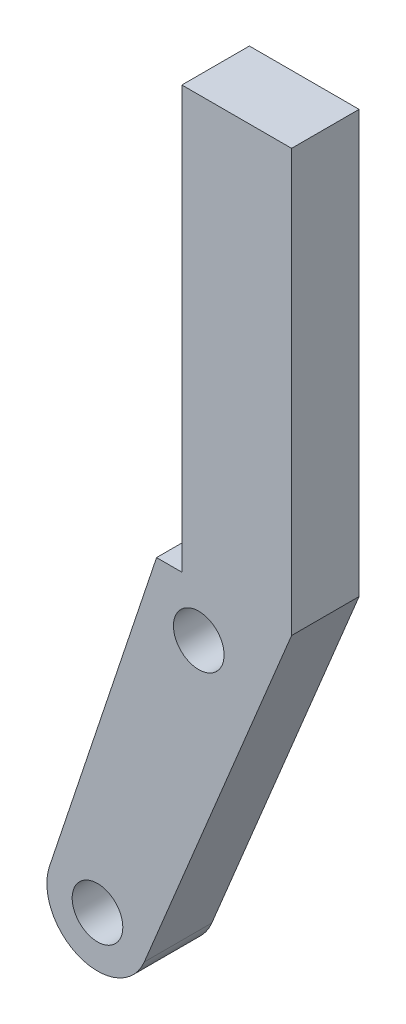
ISO-10303-21;
HEADER;
FILE_DESCRIPTION(('STEP AP214'),'2;1');
FILE_NAME('part.step','',(''),(''),'','','');
FILE_SCHEMA(('AUTOMOTIVE_DESIGN { 1 0 10303 214 1 1 1 1 }'));
ENDSEC;
DATA;
#1=APPLICATION_CONTEXT('core data for automotive mechanical design processes');
#2=APPLICATION_PROTOCOL_DEFINITION('international standard','automotive_design',2000,#1);
#3=PRODUCT_CONTEXT('',#1,'mechanical');
#4=PRODUCT('Part','Part','',(#3));
#5=PRODUCT_RELATED_PRODUCT_CATEGORY('part','',(#4));
#6=PRODUCT_DEFINITION_FORMATION('','',#4);
#7=PRODUCT_DEFINITION_CONTEXT('part definition',#1,'design');
#8=PRODUCT_DEFINITION('design','',#6,#7);
#9=PRODUCT_DEFINITION_SHAPE('','',#8);
#10=(LENGTH_UNIT() NAMED_UNIT(*) SI_UNIT(.MILLI.,.METRE.));
#11=(NAMED_UNIT(*) PLANE_ANGLE_UNIT() SI_UNIT($,.RADIAN.));
#12=(NAMED_UNIT(*) SI_UNIT($,.STERADIAN.) SOLID_ANGLE_UNIT());
#13=UNCERTAINTY_MEASURE_WITH_UNIT(LENGTH_MEASURE(1.E-05),#10,'distance_accuracy_value','');
#14=(GEOMETRIC_REPRESENTATION_CONTEXT(3) GLOBAL_UNCERTAINTY_ASSIGNED_CONTEXT((#13)) GLOBAL_UNIT_ASSIGNED_CONTEXT((#10,
#11,#12)) REPRESENTATION_CONTEXT('',''));
#15=CARTESIAN_POINT('',(0.,0.,0.));
#16=DIRECTION('',(0.,0.,1.));
#17=DIRECTION('',(1.,0.,0.));
#18=AXIS2_PLACEMENT_3D('',#15,#16,#17);
#19=CARTESIAN_POINT('',(2.99999986010677,2.99999992067627,8.00000018998981));
#20=DIRECTION('',(0.,0.,1.));
#21=DIRECTION('',(1.,0.,0.));
#22=AXIS2_PLACEMENT_3D('',#19,#20,#21);
#23=PLANE('',#22);
#24=CARTESIAN_POINT('',(3.00000003726797,2.99999994981659,8.00000018998981));
#25=DIRECTION('',(0.,0.,1.));
#26=DIRECTION('',(1.,0.,0.));
#27=AXIS2_PLACEMENT_3D('',#24,#25,#26);
#28=CIRCLE('',#27,1.50000000892132);
#29=CARTESIAN_POINT('',(4.50000004618928,2.99999994981659,8.00000018998981));
#30=VERTEX_POINT('',#29);
#31=EDGE_CURVE('E195',#30,#30,#28,.T.);
#32=ORIENTED_EDGE('',*,*,#31,.F.);
#33=EDGE_LOOP('',(#32));
#34=FACE_BOUND('',#33,.T.);
#35=DIRECTION('',(-0.316479575907035,-0.948599324284865,0.));
#36=VECTOR('',#35,1.);
#37=CARTESIAN_POINT('',(6.50000013411045,22.9700021445751,8.00000018998981));
#38=LINE('',#37,#36);
#39=CARTESIAN_POINT('',(6.50000013411045,22.9700021445751,8.00000018998981));
#40=VERTEX_POINT('',#39);
#41=CARTESIAN_POINT('',(0.154201944390759,3.94943862933432,8.00000018998981));
#42=VERTEX_POINT('',#41);
#43=EDGE_CURVE('E213',#40,#42,#38,.T.);
#44=ORIENTED_EDGE('',*,*,#43,.T.);
#45=CARTESIAN_POINT('',(2.99999986010677,2.99999992067627,8.00000018998981));
#46=DIRECTION('',(0.,0.,1.));
#47=DIRECTION('',(1.,0.,0.));
#48=AXIS2_PLACEMENT_3D('',#45,#46,#47);
#49=CIRCLE('',#48,2.99999993976531);
#50=CARTESIAN_POINT('',(5.77252059530688,1.85408176850428,8.00000018998981));
#51=VERTEX_POINT('',#50);
#52=EDGE_CURVE('E148',#42,#51,#49,.T.);
#53=ORIENTED_EDGE('',*,*,#52,.T.);
#54=DIRECTION('',(-0.381972725059998,-0.92417359695581,0.));
#55=VECTOR('',#54,1.);
#56=CARTESIAN_POINT('',(14.4999995827675,22.9700021445751,8.00000018998981));
#57=LINE('',#56,#55);
#58=CARTESIAN_POINT('',(14.4999995827675,22.9700021445751,8.00000018998981));
#59=VERTEX_POINT('',#58);
#60=EDGE_CURVE('E183',#59,#51,#57,.T.);
#61=ORIENTED_EDGE('',*,*,#60,.F.);
#62=DIRECTION('',(0.,-1.,0.));
#63=VECTOR('',#62,1.);
#64=CARTESIAN_POINT('',(14.4999995827675,47.970000654459,8.00000018998981));
#65=LINE('',#64,#63);
#66=CARTESIAN_POINT('',(14.4999995827675,47.970000654459,8.00000018998981));
#67=VERTEX_POINT('',#66);
#68=EDGE_CURVE('E179',#67,#59,#65,.T.);
#69=ORIENTED_EDGE('',*,*,#68,.F.);
#70=DIRECTION('',(1.,0.,0.));
#71=VECTOR('',#70,1.);
#72=CARTESIAN_POINT('',(8.00000037997961,47.970000654459,8.00000018998981));
#73=LINE('',#72,#71);
#74=CARTESIAN_POINT('',(8.00000037997961,47.970000654459,8.00000018998981));
#75=VERTEX_POINT('',#74);
#76=EDGE_CURVE('E164',#75,#67,#73,.T.);
#77=ORIENTED_EDGE('',*,*,#76,.F.);
#78=DIRECTION('',(0.,-1.,0.));
#79=VECTOR('',#78,1.);
#80=CARTESIAN_POINT('',(8.00000037997961,47.970000654459,8.00000018998981));
#81=LINE('',#80,#79);
#82=CARTESIAN_POINT('',(8.00000037997961,22.9700021445751,8.00000018998981));
#83=VERTEX_POINT('',#82);
#84=EDGE_CURVE('E171',#75,#83,#81,.T.);
#85=ORIENTED_EDGE('',*,*,#84,.T.);
#86=DIRECTION('',(-1.,0.,0.));
#87=VECTOR('',#86,1.);
#88=CARTESIAN_POINT('',(8.00000037997961,22.9700021445751,8.00000018998981));
#89=LINE('',#88,#87);
#90=EDGE_CURVE('E109',#83,#40,#89,.T.);
#91=ORIENTED_EDGE('',*,*,#90,.T.);
#92=EDGE_LOOP('',(#44,#53,#61,#69,#77,#85,#91));
#93=FACE_BOUND('',#92,.T.);
#94=CARTESIAN_POINT('',(9.00000017241399,19.969999637262,8.00000018998981));
#95=DIRECTION('',(0.,0.,1.));
#96=DIRECTION('',(1.,0.,0.));
#97=AXIS2_PLACEMENT_3D('',#94,#95,#96);
#98=CIRCLE('',#97,1.49999994628253);
#99=CARTESIAN_POINT('',(10.5000001186965,19.969999637262,8.00000018998981));
#100=VERTEX_POINT('',#99);
#101=EDGE_CURVE('E246',#100,#100,#98,.T.);
#102=ORIENTED_EDGE('',*,*,#101,.F.);
#103=EDGE_LOOP('',(#102));
#104=FACE_BOUND('',#103,.T.);
#105=ADVANCED_FACE('F91',(#34,#93,#104),#23,.T.);
#106=CARTESIAN_POINT('',(2.99999986010677,2.99999992067627,4.00000018998981));
#107=DIRECTION('',(0.,0.,1.));
#108=DIRECTION('',(1.,0.,0.));
#109=AXIS2_PLACEMENT_3D('',#106,#107,#108);
#110=PLANE('',#109);
#111=DIRECTION('',(-0.316479575907035,-0.948599324284865,0.));
#112=VECTOR('',#111,1.);
#113=CARTESIAN_POINT('',(6.50000013411045,22.9700021445751,4.00000018998981));
#114=LINE('',#113,#112);
#115=CARTESIAN_POINT('',(6.50000013411045,22.9700021445751,4.00000018998981));
#116=VERTEX_POINT('',#115);
#117=CARTESIAN_POINT('',(0.154201944390759,3.94943862933432,4.00000018998981));
#118=VERTEX_POINT('',#117);
#119=EDGE_CURVE('E190',#116,#118,#114,.T.);
#120=ORIENTED_EDGE('',*,*,#119,.F.);
#121=DIRECTION('',(-1.,0.,0.));
#122=VECTOR('',#121,1.);
#123=CARTESIAN_POINT('',(8.00000037997961,22.9700021445751,4.00000018998981));
#124=LINE('',#123,#122);
#125=CARTESIAN_POINT('',(8.00000037997961,22.9700021445751,4.00000018998981));
#126=VERTEX_POINT('',#125);
#127=EDGE_CURVE('E140',#126,#116,#124,.T.);
#128=ORIENTED_EDGE('',*,*,#127,.F.);
#129=DIRECTION('',(0.,-1.,0.));
#130=VECTOR('',#129,1.);
#131=CARTESIAN_POINT('',(8.00000037997961,47.970000654459,4.00000018998981));
#132=LINE('',#131,#130);
#133=CARTESIAN_POINT('',(8.00000037997961,47.970000654459,4.00000018998981));
#134=VERTEX_POINT('',#133);
#135=EDGE_CURVE('E134',#134,#126,#132,.T.);
#136=ORIENTED_EDGE('',*,*,#135,.F.);
#137=DIRECTION('',(1.,0.,0.));
#138=VECTOR('',#137,1.);
#139=CARTESIAN_POINT('',(8.00000037997961,47.970000654459,4.00000018998981));
#140=LINE('',#139,#138);
#141=CARTESIAN_POINT('',(14.4999995827675,47.970000654459,4.00000018998981));
#142=VERTEX_POINT('',#141);
#143=EDGE_CURVE('E166',#134,#142,#140,.T.);
#144=ORIENTED_EDGE('',*,*,#143,.T.);
#145=DIRECTION('',(0.,-1.,0.));
#146=VECTOR('',#145,1.);
#147=CARTESIAN_POINT('',(14.4999995827675,47.970000654459,4.00000018998981));
#148=LINE('',#147,#146);
#149=CARTESIAN_POINT('',(14.4999995827675,22.9700021445751,4.00000018998981));
#150=VERTEX_POINT('',#149);
#151=EDGE_CURVE('E203',#142,#150,#148,.T.);
#152=ORIENTED_EDGE('',*,*,#151,.T.);
#153=DIRECTION('',(-0.381972725059998,-0.92417359695581,0.));
#154=VECTOR('',#153,1.);
#155=CARTESIAN_POINT('',(14.4999995827675,22.9700021445751,4.00000018998981));
#156=LINE('',#155,#154);
#157=CARTESIAN_POINT('',(5.77252059530688,1.85408176850428,4.00000018998981));
#158=VERTEX_POINT('',#157);
#159=EDGE_CURVE('E199',#150,#158,#156,.T.);
#160=ORIENTED_EDGE('',*,*,#159,.T.);
#161=CARTESIAN_POINT('',(2.99999986010677,2.99999992067627,4.00000018998981));
#162=DIRECTION('',(0.,0.,1.));
#163=DIRECTION('',(1.,0.,0.));
#164=AXIS2_PLACEMENT_3D('',#161,#162,#163);
#165=CIRCLE('',#164,2.99999993976531);
#166=EDGE_CURVE('E194',#118,#158,#165,.T.);
#167=ORIENTED_EDGE('',*,*,#166,.F.);
#168=EDGE_LOOP('',(#120,#128,#136,#144,#152,#160,#167));
#169=FACE_BOUND('',#168,.T.);
#170=CARTESIAN_POINT('',(3.00000003726797,2.99999994981659,4.00000018998981));
#171=DIRECTION('',(0.,0.,1.));
#172=DIRECTION('',(1.,0.,0.));
#173=AXIS2_PLACEMENT_3D('',#170,#171,#172);
#174=CIRCLE('',#173,1.50000000892132);
#175=CARTESIAN_POINT('',(4.50000004618928,2.99999994981659,4.00000018998981));
#176=VERTEX_POINT('',#175);
#177=EDGE_CURVE('E242',#176,#176,#174,.T.);
#178=ORIENTED_EDGE('',*,*,#177,.T.);
#179=EDGE_LOOP('',(#178));
#180=FACE_BOUND('',#179,.T.);
#181=CARTESIAN_POINT('',(9.00000017241399,19.969999637262,4.00000018998981));
#182=DIRECTION('',(0.,0.,1.));
#183=DIRECTION('',(1.,0.,0.));
#184=AXIS2_PLACEMENT_3D('',#181,#182,#183);
#185=CIRCLE('',#184,1.49999994628253);
#186=CARTESIAN_POINT('',(10.5000001186965,19.969999637262,4.00000018998981));
#187=VERTEX_POINT('',#186);
#188=EDGE_CURVE('E250',#187,#187,#185,.T.);
#189=ORIENTED_EDGE('',*,*,#188,.T.);
#190=EDGE_LOOP('',(#189));
#191=FACE_BOUND('',#190,.T.);
#192=ADVANCED_FACE('F231',(#169,#180,#191),#110,.F.);
#193=CARTESIAN_POINT('',(6.50000013411045,22.9700021445751,8.00000018998981));
#194=DIRECTION('',(0.948599324284865,-0.316479575907035,0.));
#195=DIRECTION('',(0.316479575907035,0.948599324284866,0.));
#196=AXIS2_PLACEMENT_3D('',#193,#194,#195);
#197=PLANE('',#196);
#198=ORIENTED_EDGE('',*,*,#119,.T.);
#199=DIRECTION('',(0.,0.,-1.));
#200=VECTOR('',#199,1.);
#201=CARTESIAN_POINT('',(0.154201944390759,3.94943862933432,8.00000018998981));
#202=LINE('',#201,#200);
#203=EDGE_CURVE('E12',#42,#118,#202,.T.);
#204=ORIENTED_EDGE('',*,*,#203,.F.);
#205=ORIENTED_EDGE('',*,*,#43,.F.);
#206=DIRECTION('',(0.,0.,-1.));
#207=VECTOR('',#206,1.);
#208=CARTESIAN_POINT('',(6.50000013411045,22.9700021445751,8.00000018998981));
#209=LINE('',#208,#207);
#210=EDGE_CURVE('E189',#40,#116,#209,.T.);
#211=ORIENTED_EDGE('',*,*,#210,.T.);
#212=EDGE_LOOP('',(#198,#204,#205,#211));
#213=FACE_BOUND('',#212,.T.);
#214=ADVANCED_FACE('F93',(#213),#197,.F.);
#215=CARTESIAN_POINT('',(2.99999986010677,2.99999992067627,8.00000018998981));
#216=DIRECTION('',(0.,0.,-1.));
#217=DIRECTION('',(-1.,0.,0.));
#218=AXIS2_PLACEMENT_3D('',#215,#216,#217);
#219=CYLINDRICAL_SURFACE('',#218,2.99999993976531);
#220=ORIENTED_EDGE('',*,*,#166,.T.);
#221=DIRECTION('',(0.,0.,-1.));
#222=VECTOR('',#221,1.);
#223=CARTESIAN_POINT('',(5.77252059530688,1.85408176850428,8.00000018998981));
#224=LINE('',#223,#222);
#225=EDGE_CURVE('E101',#51,#158,#224,.T.);
#226=ORIENTED_EDGE('',*,*,#225,.F.);
#227=ORIENTED_EDGE('',*,*,#52,.F.);
#228=ORIENTED_EDGE('',*,*,#203,.T.);
#229=EDGE_LOOP('',(#220,#226,#227,#228));
#230=FACE_BOUND('',#229,.T.);
#231=ADVANCED_FACE('F227',(#230),#219,.T.);
#232=CARTESIAN_POINT('',(14.4999995827675,22.9700021445751,8.00000018998981));
#233=DIRECTION('',(0.92417359695581,-0.381972725059998,0.));
#234=DIRECTION('',(0.381972725059998,0.92417359695581,0.));
#235=AXIS2_PLACEMENT_3D('',#232,#233,#234);
#236=PLANE('',#235);
#237=ORIENTED_EDGE('',*,*,#159,.F.);
#238=DIRECTION('',(0.,0.,-1.));
#239=VECTOR('',#238,1.);
#240=CARTESIAN_POINT('',(14.4999995827675,22.9700021445751,8.00000018998981));
#241=LINE('',#240,#239);
#242=EDGE_CURVE('E220',#59,#150,#241,.T.);
#243=ORIENTED_EDGE('',*,*,#242,.F.);
#244=ORIENTED_EDGE('',*,*,#60,.T.);
#245=ORIENTED_EDGE('',*,*,#225,.T.);
#246=EDGE_LOOP('',(#237,#243,#244,#245));
#247=FACE_BOUND('',#246,.T.);
#248=ADVANCED_FACE('F226',(#247),#236,.T.);
#249=CARTESIAN_POINT('',(14.4999995827675,47.970000654459,8.00000018998981));
#250=DIRECTION('',(1.,0.,0.));
#251=DIRECTION('',(0.,0.,-1.));
#252=AXIS2_PLACEMENT_3D('',#249,#250,#251);
#253=PLANE('',#252);
#254=ORIENTED_EDGE('',*,*,#151,.F.);
#255=DIRECTION('',(0.,0.,-1.));
#256=VECTOR('',#255,1.);
#257=CARTESIAN_POINT('',(14.4999995827675,47.970000654459,8.00000018998981));
#258=LINE('',#257,#256);
#259=EDGE_CURVE('E168',#67,#142,#258,.T.);
#260=ORIENTED_EDGE('',*,*,#259,.F.);
#261=ORIENTED_EDGE('',*,*,#68,.T.);
#262=ORIENTED_EDGE('',*,*,#242,.T.);
#263=EDGE_LOOP('',(#254,#260,#261,#262));
#264=FACE_BOUND('',#263,.T.);
#265=ADVANCED_FACE('F235',(#264),#253,.T.);
#266=CARTESIAN_POINT('',(8.00000037997961,47.970000654459,8.00000018998981));
#267=DIRECTION('',(0.,1.,0.));
#268=DIRECTION('',(0.,0.,1.));
#269=AXIS2_PLACEMENT_3D('',#266,#267,#268);
#270=PLANE('',#269);
#271=ORIENTED_EDGE('',*,*,#143,.F.);
#272=DIRECTION('',(0.,0.,-1.));
#273=VECTOR('',#272,1.);
#274=CARTESIAN_POINT('',(8.00000037997961,47.970000654459,8.00000018998981));
#275=LINE('',#274,#273);
#276=EDGE_CURVE('E160',#75,#134,#275,.T.);
#277=ORIENTED_EDGE('',*,*,#276,.F.);
#278=ORIENTED_EDGE('',*,*,#76,.T.);
#279=ORIENTED_EDGE('',*,*,#259,.T.);
#280=EDGE_LOOP('',(#271,#277,#278,#279));
#281=FACE_BOUND('',#280,.T.);
#282=ADVANCED_FACE('F162',(#281),#270,.T.);
#283=CARTESIAN_POINT('',(8.00000037997961,47.970000654459,8.00000018998981));
#284=DIRECTION('',(1.,0.,0.));
#285=DIRECTION('',(0.,0.,-1.));
#286=AXIS2_PLACEMENT_3D('',#283,#284,#285);
#287=PLANE('',#286);
#288=ORIENTED_EDGE('',*,*,#135,.T.);
#289=DIRECTION('',(0.,0.,-1.));
#290=VECTOR('',#289,1.);
#291=CARTESIAN_POINT('',(8.00000037997961,22.9700021445751,8.00000018998981));
#292=LINE('',#291,#290);
#293=EDGE_CURVE('E169',#83,#126,#292,.T.);
#294=ORIENTED_EDGE('',*,*,#293,.F.);
#295=ORIENTED_EDGE('',*,*,#84,.F.);
#296=ORIENTED_EDGE('',*,*,#276,.T.);
#297=EDGE_LOOP('',(#288,#294,#295,#296));
#298=FACE_BOUND('',#297,.T.);
#299=ADVANCED_FACE('F172',(#298),#287,.F.);
#300=CARTESIAN_POINT('',(8.00000037997961,22.9700021445751,8.00000018998981));
#301=DIRECTION('',(0.,-1.,0.));
#302=DIRECTION('',(0.,0.,-1.));
#303=AXIS2_PLACEMENT_3D('',#300,#301,#302);
#304=PLANE('',#303);
#305=ORIENTED_EDGE('',*,*,#127,.T.);
#306=ORIENTED_EDGE('',*,*,#210,.F.);
#307=ORIENTED_EDGE('',*,*,#90,.F.);
#308=ORIENTED_EDGE('',*,*,#293,.T.);
#309=EDGE_LOOP('',(#305,#306,#307,#308));
#310=FACE_BOUND('',#309,.T.);
#311=ADVANCED_FACE('F272',(#310),#304,.F.);
#312=CARTESIAN_POINT('',(3.00000003726797,2.99999994981659,8.00000018998981));
#313=DIRECTION('',(0.,0.,-1.));
#314=DIRECTION('',(-1.,0.,0.));
#315=AXIS2_PLACEMENT_3D('',#312,#313,#314);
#316=CYLINDRICAL_SURFACE('',#315,1.50000000892132);
#317=ORIENTED_EDGE('',*,*,#31,.T.);
#318=EDGE_LOOP('',(#317));
#319=FACE_BOUND('',#318,.T.);
#320=ORIENTED_EDGE('',*,*,#177,.F.);
#321=EDGE_LOOP('',(#320));
#322=FACE_BOUND('',#321,.T.);
#323=ADVANCED_FACE('F269',(#319,#322),#316,.F.);
#324=CARTESIAN_POINT('',(9.00000017241399,19.969999637262,8.00000018998981));
#325=DIRECTION('',(0.,0.,-1.));
#326=DIRECTION('',(-1.,0.,0.));
#327=AXIS2_PLACEMENT_3D('',#324,#325,#326);
#328=CYLINDRICAL_SURFACE('',#327,1.49999994628253);
#329=ORIENTED_EDGE('',*,*,#101,.T.);
#330=EDGE_LOOP('',(#329));
#331=FACE_BOUND('',#330,.T.);
#332=ORIENTED_EDGE('',*,*,#188,.F.);
#333=EDGE_LOOP('',(#332));
#334=FACE_BOUND('',#333,.T.);
#335=ADVANCED_FACE('F258',(#331,#334),#328,.F.);
#336=CLOSED_SHELL('',(#105,#192,#214,#231,#248,#265,#282,#299,#311,#323,#335));
#337=MANIFOLD_SOLID_BREP('B2',#336);
#338=ADVANCED_BREP_SHAPE_REPRESENTATION('',(#18,#337),#14);
#339=SHAPE_DEFINITION_REPRESENTATION(#9,#338);
ENDSEC;
END-ISO-10303-21;
